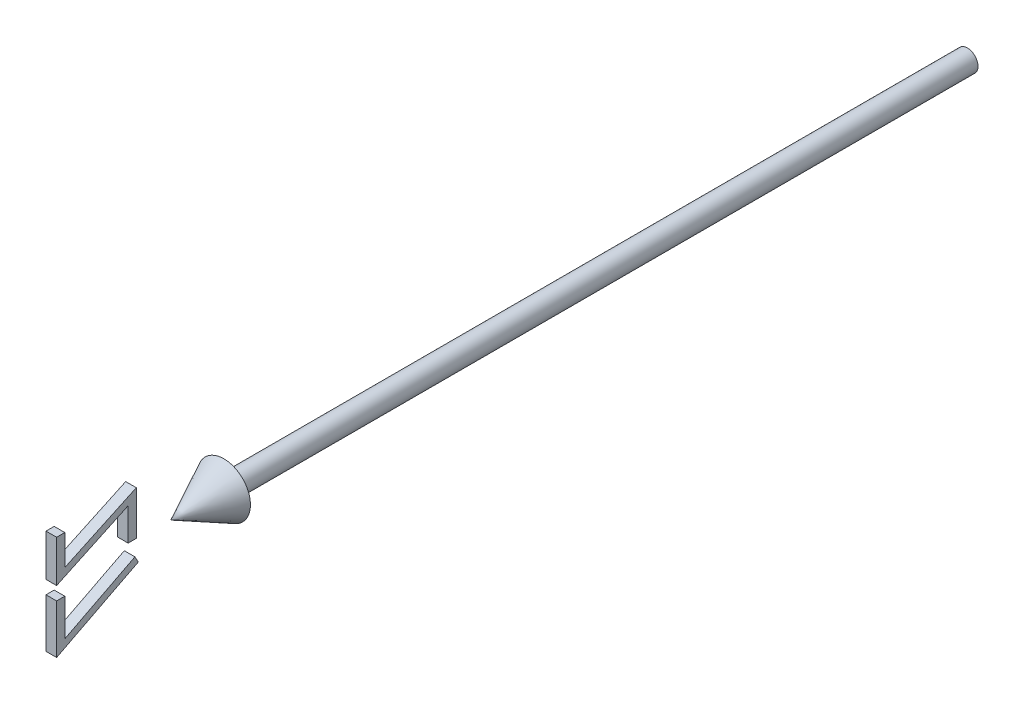
ISO-10303-21;
HEADER;
FILE_DESCRIPTION(('STEP AP214'),'2;1');
FILE_NAME('part.step','',(''),(''),'','','');
FILE_SCHEMA(('AUTOMOTIVE_DESIGN { 1 0 10303 214 1 1 1 1 }'));
ENDSEC;
DATA;
#1=APPLICATION_CONTEXT('core data for automotive mechanical design processes');
#2=APPLICATION_PROTOCOL_DEFINITION('international standard','automotive_design',2000,#1);
#3=PRODUCT_CONTEXT('',#1,'mechanical');
#4=PRODUCT('Part','Part','',(#3));
#5=PRODUCT_RELATED_PRODUCT_CATEGORY('part','',(#4));
#6=PRODUCT_DEFINITION_FORMATION('','',#4);
#7=PRODUCT_DEFINITION_CONTEXT('part definition',#1,'design');
#8=PRODUCT_DEFINITION('design','',#6,#7);
#9=PRODUCT_DEFINITION_SHAPE('','',#8);
#10=(LENGTH_UNIT() NAMED_UNIT(*) SI_UNIT(.MILLI.,.METRE.));
#11=(NAMED_UNIT(*) PLANE_ANGLE_UNIT() SI_UNIT($,.RADIAN.));
#12=(NAMED_UNIT(*) SI_UNIT($,.STERADIAN.) SOLID_ANGLE_UNIT());
#13=UNCERTAINTY_MEASURE_WITH_UNIT(LENGTH_MEASURE(1.E-05),#10,'distance_accuracy_value','');
#14=(GEOMETRIC_REPRESENTATION_CONTEXT(3) GLOBAL_UNCERTAINTY_ASSIGNED_CONTEXT((#13)) GLOBAL_UNIT_ASSIGNED_CONTEXT((#10,
#11,#12)) REPRESENTATION_CONTEXT('',''));
#15=CARTESIAN_POINT('',(0.,0.,0.));
#16=DIRECTION('',(0.,0.,1.));
#17=DIRECTION('',(1.,0.,0.));
#18=AXIS2_PLACEMENT_3D('',#15,#16,#17);
#19=CARTESIAN_POINT('',(1.00000000000009,-1.42602886329697,170.961538461538));
#20=DIRECTION('',(0.,-1.,0.));
#21=DIRECTION('',(0.,0.,-1.));
#22=AXIS2_PLACEMENT_3D('',#19,#20,#21);
#23=PLANE('',#22);
#24=DIRECTION('',(-1.,0.,0.));
#25=VECTOR('',#24,1.);
#26=CARTESIAN_POINT('',(1.00000000000009,-1.42602886329697,170.961538461538));
#27=LINE('',#26,#25);
#28=CARTESIAN_POINT('',(1.00000000000009,-1.42602886329697,170.961538461538));
#29=VERTEX_POINT('',#28);
#30=CARTESIAN_POINT('',(-0.999999999999906,-1.42602886329697,170.961538461538));
#31=VERTEX_POINT('',#30);
#32=EDGE_CURVE('E116',#29,#31,#27,.T.);
#33=ORIENTED_EDGE('',*,*,#32,.T.);
#34=DIRECTION('',(0.,0.,1.));
#35=VECTOR('',#34,1.);
#36=CARTESIAN_POINT('',(-0.999999999999906,-1.42602886329697,170.961538461538));
#37=LINE('',#36,#35);
#38=CARTESIAN_POINT('',(-0.999999999999895,-1.42602886329697,172.5));
#39=VERTEX_POINT('',#38);
#40=EDGE_CURVE('E110',#31,#39,#37,.T.);
#41=ORIENTED_EDGE('',*,*,#40,.T.);
#42=DIRECTION('',(-1.,0.,0.));
#43=VECTOR('',#42,1.);
#44=CARTESIAN_POINT('',(1.0000000000001,-1.42602886329697,172.5));
#45=LINE('',#44,#43);
#46=CARTESIAN_POINT('',(1.0000000000001,-1.42602886329697,172.5));
#47=VERTEX_POINT('',#46);
#48=EDGE_CURVE('E12',#47,#39,#45,.T.);
#49=ORIENTED_EDGE('',*,*,#48,.F.);
#50=DIRECTION('',(0.,0.,1.));
#51=VECTOR('',#50,1.);
#52=CARTESIAN_POINT('',(1.00000000000009,-1.42602886329697,170.961538461538));
#53=LINE('',#52,#51);
#54=EDGE_CURVE('E128',#29,#47,#53,.T.);
#55=ORIENTED_EDGE('',*,*,#54,.F.);
#56=EDGE_LOOP('',(#33,#41,#49,#55));
#57=FACE_BOUND('',#56,.T.);
#58=ADVANCED_FACE('F46',(#57),#23,.F.);
#59=CARTESIAN_POINT('',(1.0000000000001,-1.42602886329697,172.5));
#60=DIRECTION('',(0.,0.,-1.));
#61=DIRECTION('',(-1.,0.,0.));
#62=AXIS2_PLACEMENT_3D('',#59,#60,#61);
#63=PLANE('',#62);
#64=ORIENTED_EDGE('',*,*,#48,.T.);
#65=DIRECTION('',(0.,-1.,0.));
#66=VECTOR('',#65,1.);
#67=CARTESIAN_POINT('',(-0.999999999999895,-1.42602886329697,172.5));
#68=LINE('',#67,#66);
#69=CARTESIAN_POINT('',(-0.999999999999895,-10.6567980940662,172.5));
#70=VERTEX_POINT('',#69);
#71=EDGE_CURVE('E100',#39,#70,#68,.T.);
#72=ORIENTED_EDGE('',*,*,#71,.T.);
#73=DIRECTION('',(-1.,0.,0.));
#74=VECTOR('',#73,1.);
#75=CARTESIAN_POINT('',(1.0000000000001,-10.6567980940662,172.5));
#76=LINE('',#75,#74);
#77=CARTESIAN_POINT('',(1.0000000000001,-10.6567980940662,172.5));
#78=VERTEX_POINT('',#77);
#79=EDGE_CURVE('E53',#78,#70,#76,.T.);
#80=ORIENTED_EDGE('',*,*,#79,.F.);
#81=DIRECTION('',(0.,-1.,0.));
#82=VECTOR('',#81,1.);
#83=CARTESIAN_POINT('',(1.0000000000001,-1.42602886329697,172.5));
#84=LINE('',#83,#82);
#85=EDGE_CURVE('E101',#47,#78,#84,.T.);
#86=ORIENTED_EDGE('',*,*,#85,.F.);
#87=EDGE_LOOP('',(#64,#72,#80,#86));
#88=FACE_BOUND('',#87,.T.);
#89=ADVANCED_FACE('F98',(#88),#63,.F.);
#90=CARTESIAN_POINT('',(1.0000000000001,-10.6567980940662,172.5));
#91=DIRECTION('',(0.,0.889933250556875,0.456090790910399));
#92=DIRECTION('',(0.,-0.456090790910399,0.889933250556875));
#93=AXIS2_PLACEMENT_3D('',#90,#91,#92);
#94=PLANE('',#93);
#95=ORIENTED_EDGE('',*,*,#79,.T.);
#96=DIRECTION('',(0.,0.456090790910399,-0.889933250556875));
#97=VECTOR('',#96,1.);
#98=CARTESIAN_POINT('',(-0.999999999999895,-10.6567980940662,172.5));
#99=LINE('',#98,#97);
#100=CARTESIAN_POINT('',(-1.,-2.77218270945082,157.115384615385));
#101=VERTEX_POINT('',#100);
#102=EDGE_CURVE('E114',#70,#101,#99,.T.);
#103=ORIENTED_EDGE('',*,*,#102,.T.);
#104=DIRECTION('',(-1.,0.,0.));
#105=VECTOR('',#104,1.);
#106=CARTESIAN_POINT('',(0.999999999999997,-2.77218270945082,157.115384615385));
#107=LINE('',#106,#105);
#108=CARTESIAN_POINT('',(0.999999999999997,-2.77218270945082,157.115384615385));
#109=VERTEX_POINT('',#108);
#110=EDGE_CURVE('E142',#109,#101,#107,.T.);
#111=ORIENTED_EDGE('',*,*,#110,.F.);
#112=DIRECTION('',(0.,0.456090790910399,-0.889933250556875));
#113=VECTOR('',#112,1.);
#114=CARTESIAN_POINT('',(1.0000000000001,-10.6567980940662,172.5));
#115=LINE('',#114,#113);
#116=EDGE_CURVE('E131',#78,#109,#115,.T.);
#117=ORIENTED_EDGE('',*,*,#116,.F.);
#118=EDGE_LOOP('',(#95,#103,#111,#117));
#119=FACE_BOUND('',#118,.T.);
#120=ADVANCED_FACE('F145',(#119),#94,.F.);
#121=CARTESIAN_POINT('',(0.999999999999997,-2.77218270945082,157.115384615385));
#122=DIRECTION('',(0.,-0.482179429384508,0.876072484374684));
#123=DIRECTION('',(0.,-0.876072484374684,-0.482179429384508));
#124=AXIS2_PLACEMENT_3D('',#121,#122,#123);
#125=PLANE('',#124);
#126=ORIENTED_EDGE('',*,*,#110,.T.);
#127=DIRECTION('',(0.,0.876072484374684,0.482179429384508));
#128=VECTOR('',#127,1.);
#129=CARTESIAN_POINT('',(-1.,-2.77218270945082,157.115384615385));
#130=LINE('',#129,#128);
#131=CARTESIAN_POINT('',(-0.999999999999998,-1.60932213252774,157.755408653846));
#132=VERTEX_POINT('',#131);
#133=EDGE_CURVE('E120',#101,#132,#130,.T.);
#134=ORIENTED_EDGE('',*,*,#133,.T.);
#135=DIRECTION('',(-1.,0.,0.));
#136=VECTOR('',#135,1.);
#137=CARTESIAN_POINT('',(1.,-1.60932213252774,157.755408653846));
#138=LINE('',#137,#136);
#139=CARTESIAN_POINT('',(1.,-1.60932213252774,157.755408653846));
#140=VERTEX_POINT('',#139);
#141=EDGE_CURVE('E140',#140,#132,#138,.T.);
#142=ORIENTED_EDGE('',*,*,#141,.F.);
#143=DIRECTION('',(0.,0.876072484374684,0.482179429384508));
#144=VECTOR('',#143,1.);
#145=CARTESIAN_POINT('',(0.999999999999997,-2.77218270945082,157.115384615385));
#146=LINE('',#145,#144);
#147=EDGE_CURVE('E133',#109,#140,#146,.T.);
#148=ORIENTED_EDGE('',*,*,#147,.F.);
#149=EDGE_LOOP('',(#126,#134,#142,#148));
#150=FACE_BOUND('',#149,.T.);
#151=ADVANCED_FACE('F151',(#150),#125,.F.);
#152=CARTESIAN_POINT('',(1.,-1.60932213252774,157.755408653846));
#153=DIRECTION('',(0.,-0.889887017756643,-0.456180989989924));
#154=DIRECTION('',(0.,0.456180989989924,-0.889887017756643));
#155=AXIS2_PLACEMENT_3D('',#152,#153,#154);
#156=PLANE('',#155);
#157=ORIENTED_EDGE('',*,*,#141,.T.);
#158=DIRECTION('',(0.,-0.456180989989924,0.889887017756643));
#159=VECTOR('',#158,1.);
#160=CARTESIAN_POINT('',(-0.999999999999998,-1.60932213252774,157.755408653846));
#161=LINE('',#160,#159);
#162=CARTESIAN_POINT('',(-0.999999999999906,-8.37915386329697,170.961538461538));
#163=VERTEX_POINT('',#162);
#164=EDGE_CURVE('E123',#132,#163,#161,.T.);
#165=ORIENTED_EDGE('',*,*,#164,.T.);
#166=DIRECTION('',(-1.,0.,0.));
#167=VECTOR('',#166,1.);
#168=CARTESIAN_POINT('',(1.00000000000009,-8.37915386329697,170.961538461538));
#169=LINE('',#168,#167);
#170=CARTESIAN_POINT('',(1.00000000000009,-8.37915386329697,170.961538461538));
#171=VERTEX_POINT('',#170);
#172=EDGE_CURVE('E138',#171,#163,#169,.T.);
#173=ORIENTED_EDGE('',*,*,#172,.F.);
#174=DIRECTION('',(0.,-0.456180989989924,0.889887017756643));
#175=VECTOR('',#174,1.);
#176=CARTESIAN_POINT('',(1.,-1.60932213252774,157.755408653846));
#177=LINE('',#176,#175);
#178=EDGE_CURVE('E65',#140,#171,#177,.T.);
#179=ORIENTED_EDGE('',*,*,#178,.F.);
#180=EDGE_LOOP('',(#157,#165,#173,#179));
#181=FACE_BOUND('',#180,.T.);
#182=ADVANCED_FACE('F154',(#181),#156,.F.);
#183=CARTESIAN_POINT('',(1.00000000000009,-8.37915386329697,170.961538461538));
#184=DIRECTION('',(0.,0.,1.));
#185=DIRECTION('',(1.,0.,0.));
#186=AXIS2_PLACEMENT_3D('',#183,#184,#185);
#187=PLANE('',#186);
#188=ORIENTED_EDGE('',*,*,#172,.T.);
#189=DIRECTION('',(0.,1.,0.));
#190=VECTOR('',#189,1.);
#191=CARTESIAN_POINT('',(-0.999999999999906,-8.37915386329697,170.961538461538));
#192=LINE('',#191,#190);
#193=EDGE_CURVE('E126',#163,#31,#192,.T.);
#194=ORIENTED_EDGE('',*,*,#193,.T.);
#195=ORIENTED_EDGE('',*,*,#32,.F.);
#196=DIRECTION('',(0.,1.,0.));
#197=VECTOR('',#196,1.);
#198=CARTESIAN_POINT('',(1.00000000000009,-8.37915386329697,170.961538461538));
#199=LINE('',#198,#197);
#200=EDGE_CURVE('E60',#171,#29,#199,.T.);
#201=ORIENTED_EDGE('',*,*,#200,.F.);
#202=EDGE_LOOP('',(#188,#194,#195,#201));
#203=FACE_BOUND('',#202,.T.);
#204=ADVANCED_FACE('F156',(#203),#187,.F.);
#205=CARTESIAN_POINT('',(0.9999999999989,0.,0.));
#206=DIRECTION('',(1.,0.,0.));
#207=DIRECTION('',(0.,0.,-1.));
#208=AXIS2_PLACEMENT_3D('',#205,#206,#207);
#209=PLANE('',#208);
#210=ORIENTED_EDGE('',*,*,#54,.T.);
#211=ORIENTED_EDGE('',*,*,#85,.T.);
#212=ORIENTED_EDGE('',*,*,#116,.T.);
#213=ORIENTED_EDGE('',*,*,#147,.T.);
#214=ORIENTED_EDGE('',*,*,#178,.T.);
#215=ORIENTED_EDGE('',*,*,#200,.T.);
#216=EDGE_LOOP('',(#210,#211,#212,#213,#214,#215));
#217=FACE_BOUND('',#216,.T.);
#218=ADVANCED_FACE('F148',(#217),#209,.T.);
#219=CARTESIAN_POINT('',(-1.0000000000011,0.,0.));
#220=DIRECTION('',(1.,0.,0.));
#221=DIRECTION('',(0.,0.,-1.));
#222=AXIS2_PLACEMENT_3D('',#219,#220,#221);
#223=PLANE('',#222);
#224=ORIENTED_EDGE('',*,*,#40,.F.);
#225=ORIENTED_EDGE('',*,*,#193,.F.);
#226=ORIENTED_EDGE('',*,*,#164,.F.);
#227=ORIENTED_EDGE('',*,*,#133,.F.);
#228=ORIENTED_EDGE('',*,*,#102,.F.);
#229=ORIENTED_EDGE('',*,*,#71,.F.);
#230=EDGE_LOOP('',(#224,#225,#226,#227,#228,#229));
#231=FACE_BOUND('',#230,.T.);
#232=ADVANCED_FACE('F108',(#231),#223,.F.);
#233=CLOSED_SHELL('',(#58,#89,#120,#151,#182,#204,#218,#232));
#234=MANIFOLD_SOLID_BREP('B2',#233);
#235=CARTESIAN_POINT('',(1.00000000000009,3.24344229054918,170.961538461538));
#236=DIRECTION('',(0.,0.,1.));
#237=DIRECTION('',(1.,0.,0.));
#238=AXIS2_PLACEMENT_3D('',#235,#236,#237);
#239=PLANE('',#238);
#240=DIRECTION('',(-1.,0.,0.));
#241=VECTOR('',#240,1.);
#242=CARTESIAN_POINT('',(1.00000000000009,3.24344229054918,170.961538461538));
#243=LINE('',#242,#241);
#244=CARTESIAN_POINT('',(1.00000000000009,3.24344229054918,170.961538461538));
#245=VERTEX_POINT('',#244);
#246=CARTESIAN_POINT('',(-0.999999999999906,3.24344229054918,170.961538461538));
#247=VERTEX_POINT('',#246);
#248=EDGE_CURVE('E325',#245,#247,#243,.T.);
#249=ORIENTED_EDGE('',*,*,#248,.T.);
#250=DIRECTION('',(0.,1.,0.));
#251=VECTOR('',#250,1.);
#252=CARTESIAN_POINT('',(-0.999999999999906,3.24344229054918,170.961538461538));
#253=LINE('',#252,#251);
#254=CARTESIAN_POINT('',(-0.999999999999906,8.95858652131841,170.961538461538));
#255=VERTEX_POINT('',#254);
#256=EDGE_CURVE('E319',#247,#255,#253,.T.);
#257=ORIENTED_EDGE('',*,*,#256,.T.);
#258=DIRECTION('',(-1.,0.,0.));
#259=VECTOR('',#258,1.);
#260=CARTESIAN_POINT('',(1.00000000000009,8.95858652131841,170.961538461538));
#261=LINE('',#260,#259);
#262=CARTESIAN_POINT('',(1.00000000000009,8.95858652131841,170.961538461538));
#263=VERTEX_POINT('',#262);
#264=EDGE_CURVE('E44',#263,#255,#261,.T.);
#265=ORIENTED_EDGE('',*,*,#264,.F.);
#266=DIRECTION('',(0.,1.,0.));
#267=VECTOR('',#266,1.);
#268=CARTESIAN_POINT('',(1.00000000000009,3.24344229054918,170.961538461538));
#269=LINE('',#268,#267);
#270=EDGE_CURVE('E343',#245,#263,#269,.T.);
#271=ORIENTED_EDGE('',*,*,#270,.F.);
#272=EDGE_LOOP('',(#249,#257,#265,#271));
#273=FACE_BOUND('',#272,.T.);
#274=ADVANCED_FACE('F243',(#273),#239,.F.);
#275=CARTESIAN_POINT('',(1.00000000000009,8.95858652131841,170.961538461538));
#276=DIRECTION('',(0.,-1.,0.));
#277=DIRECTION('',(0.,0.,-1.));
#278=AXIS2_PLACEMENT_3D('',#275,#276,#277);
#279=PLANE('',#278);
#280=ORIENTED_EDGE('',*,*,#264,.T.);
#281=DIRECTION('',(0.,0.,1.));
#282=VECTOR('',#281,1.);
#283=CARTESIAN_POINT('',(-0.999999999999906,8.95858652131841,170.961538461538));
#284=LINE('',#283,#282);
#285=CARTESIAN_POINT('',(-0.999999999999895,8.95858652131841,172.5));
#286=VERTEX_POINT('',#285);
#287=EDGE_CURVE('E309',#255,#286,#284,.T.);
#288=ORIENTED_EDGE('',*,*,#287,.T.);
#289=DIRECTION('',(-1.,0.,0.));
#290=VECTOR('',#289,1.);
#291=CARTESIAN_POINT('',(1.0000000000001,8.95858652131841,172.5));
#292=LINE('',#291,#290);
#293=CARTESIAN_POINT('',(1.0000000000001,8.95858652131841,172.5));
#294=VERTEX_POINT('',#293);
#295=EDGE_CURVE('E250',#294,#286,#292,.T.);
#296=ORIENTED_EDGE('',*,*,#295,.F.);
#297=DIRECTION('',(0.,0.,1.));
#298=VECTOR('',#297,1.);
#299=CARTESIAN_POINT('',(1.00000000000009,8.95858652131841,170.961538461538));
#300=LINE('',#299,#298);
#301=EDGE_CURVE('E310',#263,#294,#300,.T.);
#302=ORIENTED_EDGE('',*,*,#301,.F.);
#303=EDGE_LOOP('',(#280,#288,#296,#302));
#304=FACE_BOUND('',#303,.T.);
#305=ADVANCED_FACE('F307',(#304),#279,.F.);
#306=CARTESIAN_POINT('',(1.0000000000001,8.95858652131841,172.5));
#307=DIRECTION('',(0.,0.,-1.));
#308=DIRECTION('',(-1.,0.,0.));
#309=AXIS2_PLACEMENT_3D('',#306,#307,#308);
#310=PLANE('',#309);
#311=ORIENTED_EDGE('',*,*,#295,.T.);
#312=DIRECTION('',(0.,-1.,0.));
#313=VECTOR('',#312,1.);
#314=CARTESIAN_POINT('',(-0.999999999999895,8.95858652131841,172.5));
#315=LINE('',#314,#313);
#316=CARTESIAN_POINT('',(-0.999999999999895,1.07397113670303,172.5));
#317=VERTEX_POINT('',#316);
#318=EDGE_CURVE('E323',#286,#317,#315,.T.);
#319=ORIENTED_EDGE('',*,*,#318,.T.);
#320=DIRECTION('',(-1.,0.,0.));
#321=VECTOR('',#320,1.);
#322=CARTESIAN_POINT('',(1.0000000000001,1.07397113670303,172.5));
#323=LINE('',#322,#321);
#324=CARTESIAN_POINT('',(1.0000000000001,1.07397113670303,172.5));
#325=VERTEX_POINT('',#324);
#326=EDGE_CURVE('E365',#325,#317,#323,.T.);
#327=ORIENTED_EDGE('',*,*,#326,.F.);
#328=DIRECTION('',(0.,-1.,0.));
#329=VECTOR('',#328,1.);
#330=CARTESIAN_POINT('',(1.0000000000001,8.95858652131841,172.5));
#331=LINE('',#330,#329);
#332=EDGE_CURVE('E346',#294,#325,#331,.T.);
#333=ORIENTED_EDGE('',*,*,#332,.F.);
#334=EDGE_LOOP('',(#311,#319,#327,#333));
#335=FACE_BOUND('',#334,.T.);
#336=ADVANCED_FACE('F368',(#335),#310,.F.);
#337=CARTESIAN_POINT('',(1.0000000000001,1.07397113670303,172.5));
#338=DIRECTION('',(0.,0.905924666699453,0.42343889555104));
#339=DIRECTION('',(0.,-0.42343889555104,0.905924666699454));
#340=AXIS2_PLACEMENT_3D('',#337,#338,#339);
#341=PLANE('',#340);
#342=ORIENTED_EDGE('',*,*,#326,.T.);
#343=DIRECTION('',(0.,0.42343889555104,-0.905924666699453));
#344=VECTOR('',#343,1.);
#345=CARTESIAN_POINT('',(-0.999999999999895,1.07397113670303,172.5));
#346=LINE('',#345,#344);
#347=CARTESIAN_POINT('',(-0.999999999999989,7.36603844439534,159.038461538462));
#348=VERTEX_POINT('',#347);
#349=EDGE_CURVE('E329',#317,#348,#346,.T.);
#350=ORIENTED_EDGE('',*,*,#349,.T.);
#351=DIRECTION('',(-1.,0.,0.));
#352=VECTOR('',#351,1.);
#353=CARTESIAN_POINT('',(1.00000000000001,7.36603844439534,159.038461538462));
#354=LINE('',#353,#352);
#355=CARTESIAN_POINT('',(1.00000000000001,7.36603844439534,159.038461538462));
#356=VERTEX_POINT('',#355);
#357=EDGE_CURVE('E363',#356,#348,#354,.T.);
#358=ORIENTED_EDGE('',*,*,#357,.F.);
#359=DIRECTION('',(0.,0.42343889555104,-0.905924666699453));
#360=VECTOR('',#359,1.);
#361=CARTESIAN_POINT('',(1.0000000000001,1.07397113670303,172.5));
#362=LINE('',#361,#360);
#363=EDGE_CURVE('E348',#325,#356,#362,.T.);
#364=ORIENTED_EDGE('',*,*,#363,.F.);
#365=EDGE_LOOP('',(#342,#350,#358,#364));
#366=FACE_BOUND('',#365,.T.);
#367=ADVANCED_FACE('F376',(#366),#341,.F.);
#368=CARTESIAN_POINT('',(1.00000000000001,7.36603844439534,159.038461538462));
#369=DIRECTION('',(0.,0.,-1.));
#370=DIRECTION('',(-1.,0.,0.));
#371=AXIS2_PLACEMENT_3D('',#368,#369,#370);
#372=PLANE('',#371);
#373=ORIENTED_EDGE('',*,*,#357,.T.);
#374=DIRECTION('',(0.,-1.,0.));
#375=VECTOR('',#374,1.);
#376=CARTESIAN_POINT('',(-0.999999999999989,7.36603844439534,159.038461538462));
#377=LINE('',#376,#375);
#378=CARTESIAN_POINT('',(-0.999999999999989,1.26627882901072,159.038461538462));
#379=VERTEX_POINT('',#378);
#380=EDGE_CURVE('E332',#348,#379,#377,.T.);
#381=ORIENTED_EDGE('',*,*,#380,.T.);
#382=DIRECTION('',(-1.,0.,0.));
#383=VECTOR('',#382,1.);
#384=CARTESIAN_POINT('',(1.00000000000001,1.26627882901072,159.038461538462));
#385=LINE('',#384,#383);
#386=CARTESIAN_POINT('',(1.00000000000001,1.26627882901072,159.038461538462));
#387=VERTEX_POINT('',#386);
#388=EDGE_CURVE('E361',#387,#379,#385,.T.);
#389=ORIENTED_EDGE('',*,*,#388,.F.);
#390=DIRECTION('',(0.,-1.,0.));
#391=VECTOR('',#390,1.);
#392=CARTESIAN_POINT('',(1.00000000000001,7.36603844439534,159.038461538462));
#393=LINE('',#392,#391);
#394=EDGE_CURVE('E350',#356,#387,#393,.T.);
#395=ORIENTED_EDGE('',*,*,#394,.F.);
#396=EDGE_LOOP('',(#373,#381,#389,#395));
#397=FACE_BOUND('',#396,.T.);
#398=ADVANCED_FACE('F379',(#397),#372,.F.);
#399=CARTESIAN_POINT('',(1.00000000000001,1.26627882901072,159.038461538462));
#400=DIRECTION('',(0.,1.,0.));
#401=DIRECTION('',(0.,0.,1.));
#402=AXIS2_PLACEMENT_3D('',#399,#400,#401);
#403=PLANE('',#402);
#404=ORIENTED_EDGE('',*,*,#388,.T.);
#405=DIRECTION('',(0.,0.,-1.));
#406=VECTOR('',#405,1.);
#407=CARTESIAN_POINT('',(-0.999999999999989,1.26627882901072,159.038461538462));
#408=LINE('',#407,#406);
#409=CARTESIAN_POINT('',(-1.,1.26627882901072,157.5));
#410=VERTEX_POINT('',#409);
#411=EDGE_CURVE('E335',#379,#410,#408,.T.);
#412=ORIENTED_EDGE('',*,*,#411,.T.);
#413=DIRECTION('',(-1.,0.,0.));
#414=VECTOR('',#413,1.);
#415=CARTESIAN_POINT('',(1.,1.26627882901072,157.5));
#416=LINE('',#415,#414);
#417=CARTESIAN_POINT('',(1.,1.26627882901072,157.5));
#418=VERTEX_POINT('',#417);
#419=EDGE_CURVE('E359',#418,#410,#416,.T.);
#420=ORIENTED_EDGE('',*,*,#419,.F.);
#421=DIRECTION('',(0.,0.,-1.));
#422=VECTOR('',#421,1.);
#423=CARTESIAN_POINT('',(1.00000000000001,1.26627882901072,159.038461538462));
#424=LINE('',#423,#422);
#425=EDGE_CURVE('E352',#387,#418,#424,.T.);
#426=ORIENTED_EDGE('',*,*,#425,.F.);
#427=EDGE_LOOP('',(#404,#412,#420,#426));
#428=FACE_BOUND('',#427,.T.);
#429=ADVANCED_FACE('F384',(#428),#403,.F.);
#430=CARTESIAN_POINT('',(1.,1.26627882901072,157.5));
#431=DIRECTION('',(0.,0.,1.));
#432=DIRECTION('',(1.,0.,0.));
#433=AXIS2_PLACEMENT_3D('',#430,#431,#432);
#434=PLANE('',#433);
#435=ORIENTED_EDGE('',*,*,#419,.T.);
#436=DIRECTION('',(0.,1.,0.));
#437=VECTOR('',#436,1.);
#438=CARTESIAN_POINT('',(-1.,1.26627882901072,157.5));
#439=LINE('',#438,#437);
#440=CARTESIAN_POINT('',(-1.,9.53550959824149,157.5));
#441=VERTEX_POINT('',#440);
#442=EDGE_CURVE('E338',#410,#441,#439,.T.);
#443=ORIENTED_EDGE('',*,*,#442,.T.);
#444=DIRECTION('',(-1.,0.,0.));
#445=VECTOR('',#444,1.);
#446=CARTESIAN_POINT('',(1.,9.53550959824149,157.5));
#447=LINE('',#446,#445);
#448=CARTESIAN_POINT('',(1.,9.53550959824149,157.5));
#449=VERTEX_POINT('',#448);
#450=EDGE_CURVE('E357',#449,#441,#447,.T.);
#451=ORIENTED_EDGE('',*,*,#450,.F.);
#452=DIRECTION('',(0.,1.,0.));
#453=VECTOR('',#452,1.);
#454=CARTESIAN_POINT('',(1.,1.26627882901072,157.5));
#455=LINE('',#454,#453);
#456=EDGE_CURVE('E262',#418,#449,#455,.T.);
#457=ORIENTED_EDGE('',*,*,#456,.F.);
#458=EDGE_LOOP('',(#435,#443,#451,#457));
#459=FACE_BOUND('',#458,.T.);
#460=ADVANCED_FACE('F387',(#459),#434,.F.);
#461=CARTESIAN_POINT('',(1.,9.53550959824149,157.5));
#462=DIRECTION('',(0.,-0.905924666699454,-0.423438895551039));
#463=DIRECTION('',(0.,0.423438895551039,-0.905924666699454));
#464=AXIS2_PLACEMENT_3D('',#461,#462,#463);
#465=PLANE('',#464);
#466=ORIENTED_EDGE('',*,*,#450,.T.);
#467=DIRECTION('',(0.,-0.423438895551039,0.905924666699454));
#468=VECTOR('',#467,1.);
#469=CARTESIAN_POINT('',(-1.,9.53550959824149,157.5));
#470=LINE('',#469,#468);
#471=EDGE_CURVE('E341',#441,#247,#470,.T.);
#472=ORIENTED_EDGE('',*,*,#471,.T.);
#473=ORIENTED_EDGE('',*,*,#248,.F.);
#474=DIRECTION('',(0.,-0.423438895551039,0.905924666699454));
#475=VECTOR('',#474,1.);
#476=CARTESIAN_POINT('',(1.,9.53550959824149,157.5));
#477=LINE('',#476,#475);
#478=EDGE_CURVE('E257',#449,#245,#477,.T.);
#479=ORIENTED_EDGE('',*,*,#478,.F.);
#480=EDGE_LOOP('',(#466,#472,#473,#479));
#481=FACE_BOUND('',#480,.T.);
#482=ADVANCED_FACE('F389',(#481),#465,.F.);
#483=CARTESIAN_POINT('',(0.9999999999989,0.,0.));
#484=DIRECTION('',(1.,0.,0.));
#485=DIRECTION('',(0.,0.,-1.));
#486=AXIS2_PLACEMENT_3D('',#483,#484,#485);
#487=PLANE('',#486);
#488=ORIENTED_EDGE('',*,*,#270,.T.);
#489=ORIENTED_EDGE('',*,*,#301,.T.);
#490=ORIENTED_EDGE('',*,*,#332,.T.);
#491=ORIENTED_EDGE('',*,*,#363,.T.);
#492=ORIENTED_EDGE('',*,*,#394,.T.);
#493=ORIENTED_EDGE('',*,*,#425,.T.);
#494=ORIENTED_EDGE('',*,*,#456,.T.);
#495=ORIENTED_EDGE('',*,*,#478,.T.);
#496=EDGE_LOOP('',(#488,#489,#490,#491,#492,#493,#494,#495));
#497=FACE_BOUND('',#496,.T.);
#498=ADVANCED_FACE('F371',(#497),#487,.T.);
#499=CARTESIAN_POINT('',(-1.0000000000011,0.,0.));
#500=DIRECTION('',(1.,0.,0.));
#501=DIRECTION('',(0.,0.,-1.));
#502=AXIS2_PLACEMENT_3D('',#499,#500,#501);
#503=PLANE('',#502);
#504=ORIENTED_EDGE('',*,*,#256,.F.);
#505=ORIENTED_EDGE('',*,*,#471,.F.);
#506=ORIENTED_EDGE('',*,*,#442,.F.);
#507=ORIENTED_EDGE('',*,*,#411,.F.);
#508=ORIENTED_EDGE('',*,*,#380,.F.);
#509=ORIENTED_EDGE('',*,*,#349,.F.);
#510=ORIENTED_EDGE('',*,*,#318,.F.);
#511=ORIENTED_EDGE('',*,*,#287,.F.);
#512=EDGE_LOOP('',(#504,#505,#506,#507,#508,#509,#510,#511));
#513=FACE_BOUND('',#512,.T.);
#514=ADVANCED_FACE('F317',(#513),#503,.F.);
#515=CLOSED_SHELL('',(#274,#305,#336,#367,#398,#429,#460,#482,#498,#514));
#516=MANIFOLD_SOLID_BREP('B6',#515);
#517=CARTESIAN_POINT('',(2.,0.,0.));
#518=DIRECTION('',(0.,0.,1.));
#519=DIRECTION('',(1.,0.,0.));
#520=AXIS2_PLACEMENT_3D('',#517,#518,#519);
#521=PLANE('',#520);
#522=CARTESIAN_POINT('',(0.,0.,0.));
#523=DIRECTION('',(0.,0.,-1.));
#524=DIRECTION('',(-1.,0.,0.));
#525=AXIS2_PLACEMENT_3D('',#522,#523,#524);
#526=CIRCLE('',#525,2.);
#527=CARTESIAN_POINT('',(-2.,0.,0.));
#528=VERTEX_POINT('',#527);
#529=EDGE_CURVE('E241',#528,#528,#526,.T.);
#530=ORIENTED_EDGE('',*,*,#529,.T.);
#531=EDGE_LOOP('',(#530));
#532=FACE_BOUND('',#531,.T.);
#533=ADVANCED_FACE('F471',(#532),#521,.F.);
#534=CARTESIAN_POINT('',(0.,0.,-41.9499520246458));
#535=DIRECTION('',(0.,0.,-1.));
#536=DIRECTION('',(-1.,0.,0.));
#537=AXIS2_PLACEMENT_3D('',#534,#535,#536);
#538=CYLINDRICAL_SURFACE('',#537,2.);
#539=ORIENTED_EDGE('',*,*,#529,.F.);
#540=EDGE_LOOP('',(#539));
#541=FACE_BOUND('',#540,.T.);
#542=CARTESIAN_POINT('',(0.,0.,140.));
#543=DIRECTION('',(0.,0.,-1.));
#544=DIRECTION('',(-1.,0.,0.));
#545=AXIS2_PLACEMENT_3D('',#542,#543,#544);
#546=CIRCLE('',#545,2.);
#547=CARTESIAN_POINT('',(-2.,0.,140.));
#548=VERTEX_POINT('',#547);
#549=EDGE_CURVE('E477',#548,#548,#546,.T.);
#550=ORIENTED_EDGE('',*,*,#549,.T.);
#551=EDGE_LOOP('',(#550));
#552=FACE_BOUND('',#551,.T.);
#553=ADVANCED_FACE('F488',(#541,#552),#538,.T.);
#554=CARTESIAN_POINT('',(5.00000000000002,0.,140.));
#555=DIRECTION('',(0.,0.,1.));
#556=DIRECTION('',(1.,0.,0.));
#557=AXIS2_PLACEMENT_3D('',#554,#555,#556);
#558=PLANE('',#557);
#559=ORIENTED_EDGE('',*,*,#549,.F.);
#560=EDGE_LOOP('',(#559));
#561=FACE_BOUND('',#560,.T.);
#562=CARTESIAN_POINT('',(0.,0.,140.));
#563=DIRECTION('',(0.,0.,-1.));
#564=DIRECTION('',(-1.,0.,0.));
#565=AXIS2_PLACEMENT_3D('',#562,#563,#564);
#566=CIRCLE('',#565,5.00000000000002);
#567=CARTESIAN_POINT('',(-5.00000000000002,0.,140.));
#568=VERTEX_POINT('',#567);
#569=EDGE_CURVE('E502',#568,#568,#566,.T.);
#570=ORIENTED_EDGE('',*,*,#569,.T.);
#571=EDGE_LOOP('',(#570));
#572=FACE_BOUND('',#571,.T.);
#573=ADVANCED_FACE('F482',(#561,#572),#558,.F.);
#574=CARTESIAN_POINT('',(0.,0.,150.));
#575=DIRECTION('',(0.,0.,-1.));
#576=DIRECTION('',(-1.,0.,0.));
#577=AXIS2_PLACEMENT_3D('',#574,#575,#576);
#578=CONICAL_SURFACE('',#577,0.,0.463647609000806);
#579=ORIENTED_EDGE('',*,*,#569,.F.);
#580=EDGE_LOOP('',(#579));
#581=FACE_BOUND('',#580,.T.);
#582=CARTESIAN_POINT('',(0.,0.,150.));
#583=VERTEX_POINT('',#582);
#584=VERTEX_LOOP('',#583);
#585=FACE_BOUND('',#584,.T.);
#586=ADVANCED_FACE('F480',(#581,#585),#578,.T.);
#587=CLOSED_SHELL('',(#533,#553,#573,#586));
#588=MANIFOLD_SOLID_BREP('B38',#587);
#589=ADVANCED_BREP_SHAPE_REPRESENTATION('',(#18,#234,#516,#588),#14);
#590=SHAPE_DEFINITION_REPRESENTATION(#9,#589);
ENDSEC;
END-ISO-10303-21;
